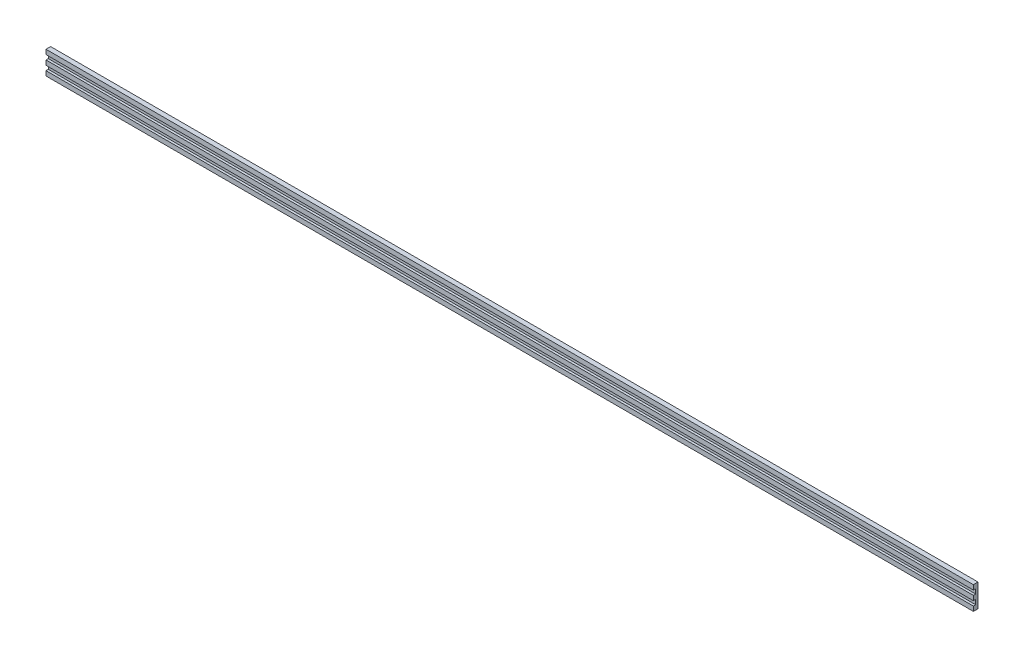
ISO-10303-21;
HEADER;
FILE_DESCRIPTION(('STEP AP214'),'2;1');
FILE_NAME('part.step','',(''),(''),'','','');
FILE_SCHEMA(('AUTOMOTIVE_DESIGN { 1 0 10303 214 1 1 1 1 }'));
ENDSEC;
DATA;
#1=APPLICATION_CONTEXT('core data for automotive mechanical design processes');
#2=APPLICATION_PROTOCOL_DEFINITION('international standard','automotive_design',2000,#1);
#3=PRODUCT_CONTEXT('',#1,'mechanical');
#4=PRODUCT('Part','Part','',(#3));
#5=PRODUCT_RELATED_PRODUCT_CATEGORY('part','',(#4));
#6=PRODUCT_DEFINITION_FORMATION('','',#4);
#7=PRODUCT_DEFINITION_CONTEXT('part definition',#1,'design');
#8=PRODUCT_DEFINITION('design','',#6,#7);
#9=PRODUCT_DEFINITION_SHAPE('','',#8);
#10=(LENGTH_UNIT() NAMED_UNIT(*) SI_UNIT(.MILLI.,.METRE.));
#11=(NAMED_UNIT(*) PLANE_ANGLE_UNIT() SI_UNIT($,.RADIAN.));
#12=(NAMED_UNIT(*) SI_UNIT($,.STERADIAN.) SOLID_ANGLE_UNIT());
#13=UNCERTAINTY_MEASURE_WITH_UNIT(LENGTH_MEASURE(1.E-05),#10,'distance_accuracy_value','');
#14=(GEOMETRIC_REPRESENTATION_CONTEXT(3) GLOBAL_UNCERTAINTY_ASSIGNED_CONTEXT((#13)) GLOBAL_UNIT_ASSIGNED_CONTEXT((#10,
#11,#12)) REPRESENTATION_CONTEXT('',''));
#15=CARTESIAN_POINT('',(0.,0.,0.));
#16=DIRECTION('',(0.,0.,1.));
#17=DIRECTION('',(1.,0.,0.));
#18=AXIS2_PLACEMENT_3D('',#15,#16,#17);
#19=CARTESIAN_POINT('',(0.,0.,0.5));
#20=DIRECTION('',(0.,0.,1.));
#21=DIRECTION('',(1.,0.,0.));
#22=AXIS2_PLACEMENT_3D('',#19,#20,#21);
#23=PLANE('',#22);
#24=DIRECTION('',(0.,-1.,0.));
#25=VECTOR('',#24,1.);
#26=CARTESIAN_POINT('',(-100.,2.5,0.5));
#27=LINE('',#26,#25);
#28=CARTESIAN_POINT('',(-100.,-0.5,0.5));
#29=VERTEX_POINT('',#28);
#30=CARTESIAN_POINT('',(-100.,-1.5,0.5));
#31=VERTEX_POINT('',#30);
#32=EDGE_CURVE('E60',#29,#31,#27,.T.);
#33=ORIENTED_EDGE('',*,*,#32,.T.);
#34=DIRECTION('',(-1.,0.,0.));
#35=VECTOR('',#34,1.);
#36=CARTESIAN_POINT('',(-100.,-1.5,0.5));
#37=LINE('',#36,#35);
#38=CARTESIAN_POINT('',(99.9999999999998,-1.5,0.5));
#39=VERTEX_POINT('',#38);
#40=EDGE_CURVE('E55',#39,#31,#37,.T.);
#41=ORIENTED_EDGE('',*,*,#40,.F.);
#42=DIRECTION('',(0.,1.,0.));
#43=VECTOR('',#42,1.);
#44=CARTESIAN_POINT('',(99.9999999999998,2.5,0.5));
#45=LINE('',#44,#43);
#46=CARTESIAN_POINT('',(99.9999999999998,-0.5,0.5));
#47=VERTEX_POINT('',#46);
#48=EDGE_CURVE('E233',#39,#47,#45,.T.);
#49=ORIENTED_EDGE('',*,*,#48,.T.);
#50=DIRECTION('',(1.,0.,0.));
#51=VECTOR('',#50,1.);
#52=CARTESIAN_POINT('',(-100.,-0.5,0.5));
#53=LINE('',#52,#51);
#54=EDGE_CURVE('E171',#29,#47,#53,.T.);
#55=ORIENTED_EDGE('',*,*,#54,.F.);
#56=EDGE_LOOP('',(#33,#41,#49,#55));
#57=FACE_BOUND('',#56,.T.);
#58=ADVANCED_FACE('F39',(#57),#23,.T.);
#59=CARTESIAN_POINT('',(-100.,1.5,0.5));
#60=VERTEX_POINT('',#59);
#61=CARTESIAN_POINT('',(-100.,0.5,0.5));
#62=VERTEX_POINT('',#61);
#63=EDGE_CURVE('E237',#60,#62,#27,.T.);
#64=ORIENTED_EDGE('',*,*,#63,.T.);
#65=DIRECTION('',(-1.,0.,0.));
#66=VECTOR('',#65,1.);
#67=CARTESIAN_POINT('',(-100.,0.5,0.5));
#68=LINE('',#67,#66);
#69=CARTESIAN_POINT('',(99.9999999999998,0.5,0.5));
#70=VERTEX_POINT('',#69);
#71=EDGE_CURVE('E177',#70,#62,#68,.T.);
#72=ORIENTED_EDGE('',*,*,#71,.F.);
#73=CARTESIAN_POINT('',(99.9999999999998,1.5,0.5));
#74=VERTEX_POINT('',#73);
#75=EDGE_CURVE('E236',#70,#74,#45,.T.);
#76=ORIENTED_EDGE('',*,*,#75,.T.);
#77=DIRECTION('',(1.,0.,0.));
#78=VECTOR('',#77,1.);
#79=CARTESIAN_POINT('',(-100.,1.5,0.5));
#80=LINE('',#79,#78);
#81=EDGE_CURVE('E205',#60,#74,#80,.T.);
#82=ORIENTED_EDGE('',*,*,#81,.F.);
#83=EDGE_LOOP('',(#64,#72,#76,#82));
#84=FACE_BOUND('',#83,.T.);
#85=ADVANCED_FACE('F272',(#84),#23,.T.);
#86=CARTESIAN_POINT('',(99.9999999999998,2.5,0.5));
#87=DIRECTION('',(-1.,0.,0.));
#88=DIRECTION('',(0.,0.,1.));
#89=AXIS2_PLACEMENT_3D('',#86,#87,#88);
#90=PLANE('',#89);
#91=DIRECTION('',(0.,1.,0.));
#92=VECTOR('',#91,1.);
#93=CARTESIAN_POINT('',(99.9999999999998,2.5,0.));
#94=LINE('',#93,#92);
#95=CARTESIAN_POINT('',(99.9999999999998,-2.5,0.));
#96=VERTEX_POINT('',#95);
#97=CARTESIAN_POINT('',(99.9999999999998,2.5,0.));
#98=VERTEX_POINT('',#97);
#99=EDGE_CURVE('E232',#96,#98,#94,.T.);
#100=ORIENTED_EDGE('',*,*,#99,.T.);
#101=DIRECTION('',(0.,0.,-1.));
#102=VECTOR('',#101,1.);
#103=CARTESIAN_POINT('',(99.9999999999998,2.5,0.5));
#104=LINE('',#103,#102);
#105=CARTESIAN_POINT('',(99.9999999999998,2.5,1.));
#106=VERTEX_POINT('',#105);
#107=EDGE_CURVE('E11',#106,#98,#104,.T.);
#108=ORIENTED_EDGE('',*,*,#107,.F.);
#109=DIRECTION('',(0.,1.,0.));
#110=VECTOR('',#109,1.);
#111=CARTESIAN_POINT('',(99.9999999999998,2.5,1.));
#112=LINE('',#111,#110);
#113=CARTESIAN_POINT('',(99.9999999999998,1.5,1.));
#114=VERTEX_POINT('',#113);
#115=EDGE_CURVE('E213',#114,#106,#112,.T.);
#116=ORIENTED_EDGE('',*,*,#115,.F.);
#117=DIRECTION('',(0.,0.,-1.));
#118=VECTOR('',#117,1.);
#119=CARTESIAN_POINT('',(99.9999999999998,1.5,1.));
#120=LINE('',#119,#118);
#121=EDGE_CURVE('E221',#114,#74,#120,.T.);
#122=ORIENTED_EDGE('',*,*,#121,.T.);
#123=ORIENTED_EDGE('',*,*,#75,.F.);
#124=DIRECTION('',(0.,0.,-1.));
#125=VECTOR('',#124,1.);
#126=CARTESIAN_POINT('',(99.9999999999998,0.5,1.));
#127=LINE('',#126,#125);
#128=CARTESIAN_POINT('',(99.9999999999998,0.5,1.));
#129=VERTEX_POINT('',#128);
#130=EDGE_CURVE('E195',#129,#70,#127,.T.);
#131=ORIENTED_EDGE('',*,*,#130,.F.);
#132=DIRECTION('',(0.,1.,0.));
#133=VECTOR('',#132,1.);
#134=CARTESIAN_POINT('',(99.9999999999998,0.5,1.));
#135=LINE('',#134,#133);
#136=CARTESIAN_POINT('',(99.9999999999998,-0.5,1.));
#137=VERTEX_POINT('',#136);
#138=EDGE_CURVE('E180',#137,#129,#135,.T.);
#139=ORIENTED_EDGE('',*,*,#138,.F.);
#140=DIRECTION('',(0.,0.,-1.));
#141=VECTOR('',#140,1.);
#142=CARTESIAN_POINT('',(99.9999999999998,-0.5,1.));
#143=LINE('',#142,#141);
#144=EDGE_CURVE('E198',#137,#47,#143,.T.);
#145=ORIENTED_EDGE('',*,*,#144,.T.);
#146=ORIENTED_EDGE('',*,*,#48,.F.);
#147=DIRECTION('',(0.,0.,-1.));
#148=VECTOR('',#147,1.);
#149=CARTESIAN_POINT('',(99.9999999999998,-1.5,1.));
#150=LINE('',#149,#148);
#151=CARTESIAN_POINT('',(99.9999999999998,-1.5,1.));
#152=VERTEX_POINT('',#151);
#153=EDGE_CURVE('E167',#152,#39,#150,.T.);
#154=ORIENTED_EDGE('',*,*,#153,.F.);
#155=DIRECTION('',(0.,1.,0.));
#156=VECTOR('',#155,1.);
#157=CARTESIAN_POINT('',(99.9999999999998,-2.5,1.));
#158=LINE('',#157,#156);
#159=CARTESIAN_POINT('',(99.9999999999998,-2.5,1.));
#160=VERTEX_POINT('',#159);
#161=EDGE_CURVE('E149',#160,#152,#158,.T.);
#162=ORIENTED_EDGE('',*,*,#161,.F.);
#163=DIRECTION('',(0.,0.,-1.));
#164=VECTOR('',#163,1.);
#165=CARTESIAN_POINT('',(99.9999999999998,-2.5,0.5));
#166=LINE('',#165,#164);
#167=EDGE_CURVE('E140',#160,#96,#166,.T.);
#168=ORIENTED_EDGE('',*,*,#167,.T.);
#169=EDGE_LOOP('',(#100,#108,#116,#122,#123,#131,#139,#145,#146,#154,#162,#168));
#170=FACE_BOUND('',#169,.T.);
#171=ADVANCED_FACE('F41',(#170),#90,.F.);
#172=CARTESIAN_POINT('',(-100.,2.5,0.5));
#173=DIRECTION('',(0.,-1.,0.));
#174=DIRECTION('',(0.,0.,-1.));
#175=AXIS2_PLACEMENT_3D('',#172,#173,#174);
#176=PLANE('',#175);
#177=DIRECTION('',(-1.,0.,0.));
#178=VECTOR('',#177,1.);
#179=CARTESIAN_POINT('',(-100.,2.5,0.));
#180=LINE('',#179,#178);
#181=CARTESIAN_POINT('',(-100.,2.5,0.));
#182=VERTEX_POINT('',#181);
#183=EDGE_CURVE('E244',#98,#182,#180,.T.);
#184=ORIENTED_EDGE('',*,*,#183,.T.);
#185=DIRECTION('',(0.,0.,-1.));
#186=VECTOR('',#185,1.);
#187=CARTESIAN_POINT('',(-100.,2.5,0.5));
#188=LINE('',#187,#186);
#189=CARTESIAN_POINT('',(-100.,2.5,1.));
#190=VERTEX_POINT('',#189);
#191=EDGE_CURVE('E48',#190,#182,#188,.T.);
#192=ORIENTED_EDGE('',*,*,#191,.F.);
#193=DIRECTION('',(-1.,0.,0.));
#194=VECTOR('',#193,1.);
#195=CARTESIAN_POINT('',(-100.,2.5,1.));
#196=LINE('',#195,#194);
#197=EDGE_CURVE('E217',#106,#190,#196,.T.);
#198=ORIENTED_EDGE('',*,*,#197,.F.);
#199=ORIENTED_EDGE('',*,*,#107,.T.);
#200=EDGE_LOOP('',(#184,#192,#198,#199));
#201=FACE_BOUND('',#200,.T.);
#202=ADVANCED_FACE('F281',(#201),#176,.F.);
#203=CARTESIAN_POINT('',(-100.,2.5,0.5));
#204=DIRECTION('',(1.,0.,0.));
#205=DIRECTION('',(0.,0.,-1.));
#206=AXIS2_PLACEMENT_3D('',#203,#204,#205);
#207=PLANE('',#206);
#208=DIRECTION('',(0.,-1.,0.));
#209=VECTOR('',#208,1.);
#210=CARTESIAN_POINT('',(-100.,2.5,0.));
#211=LINE('',#210,#209);
#212=CARTESIAN_POINT('',(-100.,-2.5,0.));
#213=VERTEX_POINT('',#212);
#214=EDGE_CURVE('E136',#182,#213,#211,.T.);
#215=ORIENTED_EDGE('',*,*,#214,.T.);
#216=DIRECTION('',(0.,0.,-1.));
#217=VECTOR('',#216,1.);
#218=CARTESIAN_POINT('',(-100.,-2.5,0.5));
#219=LINE('',#218,#217);
#220=CARTESIAN_POINT('',(-100.,-2.5,1.));
#221=VERTEX_POINT('',#220);
#222=EDGE_CURVE('E128',#221,#213,#219,.T.);
#223=ORIENTED_EDGE('',*,*,#222,.F.);
#224=DIRECTION('',(0.,-1.,0.));
#225=VECTOR('',#224,1.);
#226=CARTESIAN_POINT('',(-100.,-2.5,1.));
#227=LINE('',#226,#225);
#228=CARTESIAN_POINT('',(-100.,-1.5,1.));
#229=VERTEX_POINT('',#228);
#230=EDGE_CURVE('E133',#229,#221,#227,.T.);
#231=ORIENTED_EDGE('',*,*,#230,.F.);
#232=DIRECTION('',(0.,0.,-1.));
#233=VECTOR('',#232,1.);
#234=CARTESIAN_POINT('',(-100.,-1.5,1.));
#235=LINE('',#234,#233);
#236=EDGE_CURVE('E163',#229,#31,#235,.T.);
#237=ORIENTED_EDGE('',*,*,#236,.T.);
#238=ORIENTED_EDGE('',*,*,#32,.F.);
#239=DIRECTION('',(0.,0.,-1.));
#240=VECTOR('',#239,1.);
#241=CARTESIAN_POINT('',(-100.,-0.5,1.));
#242=LINE('',#241,#240);
#243=CARTESIAN_POINT('',(-100.,-0.5,1.));
#244=VERTEX_POINT('',#243);
#245=EDGE_CURVE('E202',#244,#29,#242,.T.);
#246=ORIENTED_EDGE('',*,*,#245,.F.);
#247=DIRECTION('',(0.,-1.,0.));
#248=VECTOR('',#247,1.);
#249=CARTESIAN_POINT('',(-100.,0.5,1.));
#250=LINE('',#249,#248);
#251=CARTESIAN_POINT('',(-100.,0.5,1.));
#252=VERTEX_POINT('',#251);
#253=EDGE_CURVE('E172',#252,#244,#250,.T.);
#254=ORIENTED_EDGE('',*,*,#253,.F.);
#255=DIRECTION('',(0.,0.,-1.));
#256=VECTOR('',#255,1.);
#257=CARTESIAN_POINT('',(-100.,0.5,1.));
#258=LINE('',#257,#256);
#259=EDGE_CURVE('E186',#252,#62,#258,.T.);
#260=ORIENTED_EDGE('',*,*,#259,.T.);
#261=ORIENTED_EDGE('',*,*,#63,.F.);
#262=DIRECTION('',(0.,0.,-1.));
#263=VECTOR('',#262,1.);
#264=CARTESIAN_POINT('',(-100.,1.5,1.));
#265=LINE('',#264,#263);
#266=CARTESIAN_POINT('',(-100.,1.5,1.));
#267=VERTEX_POINT('',#266);
#268=EDGE_CURVE('E228',#267,#60,#265,.T.);
#269=ORIENTED_EDGE('',*,*,#268,.F.);
#270=DIRECTION('',(0.,-1.,0.));
#271=VECTOR('',#270,1.);
#272=CARTESIAN_POINT('',(-100.,2.5,1.));
#273=LINE('',#272,#271);
#274=EDGE_CURVE('E206',#190,#267,#273,.T.);
#275=ORIENTED_EDGE('',*,*,#274,.F.);
#276=ORIENTED_EDGE('',*,*,#191,.T.);
#277=EDGE_LOOP('',(#215,#223,#231,#237,#238,#246,#254,#260,#261,#269,#275,#276));
#278=FACE_BOUND('',#277,.T.);
#279=ADVANCED_FACE('F130',(#278),#207,.F.);
#280=CARTESIAN_POINT('',(-100.,-2.5,0.5));
#281=DIRECTION('',(0.,1.,0.));
#282=DIRECTION('',(0.,0.,1.));
#283=AXIS2_PLACEMENT_3D('',#280,#281,#282);
#284=PLANE('',#283);
#285=DIRECTION('',(1.,0.,0.));
#286=VECTOR('',#285,1.);
#287=CARTESIAN_POINT('',(-100.,-2.5,0.));
#288=LINE('',#287,#286);
#289=EDGE_CURVE('E249',#213,#96,#288,.T.);
#290=ORIENTED_EDGE('',*,*,#289,.T.);
#291=ORIENTED_EDGE('',*,*,#167,.F.);
#292=DIRECTION('',(1.,0.,0.));
#293=VECTOR('',#292,1.);
#294=CARTESIAN_POINT('',(-100.,-2.5,1.));
#295=LINE('',#294,#293);
#296=EDGE_CURVE('E143',#221,#160,#295,.T.);
#297=ORIENTED_EDGE('',*,*,#296,.F.);
#298=ORIENTED_EDGE('',*,*,#222,.T.);
#299=EDGE_LOOP('',(#290,#291,#297,#298));
#300=FACE_BOUND('',#299,.T.);
#301=ADVANCED_FACE('F144',(#300),#284,.F.);
#302=CARTESIAN_POINT('',(0.,0.,0.));
#303=DIRECTION('',(0.,0.,1.));
#304=DIRECTION('',(1.,0.,0.));
#305=AXIS2_PLACEMENT_3D('',#302,#303,#304);
#306=PLANE('',#305);
#307=ORIENTED_EDGE('',*,*,#99,.F.);
#308=ORIENTED_EDGE('',*,*,#289,.F.);
#309=ORIENTED_EDGE('',*,*,#214,.F.);
#310=ORIENTED_EDGE('',*,*,#183,.F.);
#311=EDGE_LOOP('',(#307,#308,#309,#310));
#312=FACE_BOUND('',#311,.T.);
#313=ADVANCED_FACE('F260',(#312),#306,.F.);
#314=CARTESIAN_POINT('',(-100.,1.5,1.));
#315=DIRECTION('',(0.,1.,0.));
#316=DIRECTION('',(0.,0.,1.));
#317=AXIS2_PLACEMENT_3D('',#314,#315,#316);
#318=PLANE('',#317);
#319=ORIENTED_EDGE('',*,*,#81,.T.);
#320=ORIENTED_EDGE('',*,*,#121,.F.);
#321=DIRECTION('',(1.,0.,0.));
#322=VECTOR('',#321,1.);
#323=CARTESIAN_POINT('',(-100.,1.5,1.));
#324=LINE('',#323,#322);
#325=EDGE_CURVE('E210',#267,#114,#324,.T.);
#326=ORIENTED_EDGE('',*,*,#325,.F.);
#327=ORIENTED_EDGE('',*,*,#268,.T.);
#328=EDGE_LOOP('',(#319,#320,#326,#327));
#329=FACE_BOUND('',#328,.T.);
#330=ADVANCED_FACE('F277',(#329),#318,.F.);
#331=CARTESIAN_POINT('',(0.,0.,1.));
#332=DIRECTION('',(0.,0.,1.));
#333=DIRECTION('',(1.,0.,0.));
#334=AXIS2_PLACEMENT_3D('',#331,#332,#333);
#335=PLANE('',#334);
#336=ORIENTED_EDGE('',*,*,#274,.T.);
#337=ORIENTED_EDGE('',*,*,#325,.T.);
#338=ORIENTED_EDGE('',*,*,#115,.T.);
#339=ORIENTED_EDGE('',*,*,#197,.T.);
#340=EDGE_LOOP('',(#336,#337,#338,#339));
#341=FACE_BOUND('',#340,.T.);
#342=ADVANCED_FACE('F280',(#341),#335,.T.);
#343=CARTESIAN_POINT('',(-100.,-0.5,1.));
#344=DIRECTION('',(0.,1.,0.));
#345=DIRECTION('',(0.,0.,1.));
#346=AXIS2_PLACEMENT_3D('',#343,#344,#345);
#347=PLANE('',#346);
#348=ORIENTED_EDGE('',*,*,#54,.T.);
#349=ORIENTED_EDGE('',*,*,#144,.F.);
#350=DIRECTION('',(1.,0.,0.));
#351=VECTOR('',#350,1.);
#352=CARTESIAN_POINT('',(-100.,-0.5,1.));
#353=LINE('',#352,#351);
#354=EDGE_CURVE('E176',#244,#137,#353,.T.);
#355=ORIENTED_EDGE('',*,*,#354,.F.);
#356=ORIENTED_EDGE('',*,*,#245,.T.);
#357=EDGE_LOOP('',(#348,#349,#355,#356));
#358=FACE_BOUND('',#357,.T.);
#359=ADVANCED_FACE('F318',(#358),#347,.F.);
#360=CARTESIAN_POINT('',(-100.,0.5,1.));
#361=DIRECTION('',(0.,-1.,0.));
#362=DIRECTION('',(1.,0.,0.));
#363=AXIS2_PLACEMENT_3D('',#360,#361,#362);
#364=PLANE('',#363);
#365=ORIENTED_EDGE('',*,*,#71,.T.);
#366=ORIENTED_EDGE('',*,*,#259,.F.);
#367=DIRECTION('',(-1.,0.,0.));
#368=VECTOR('',#367,1.);
#369=CARTESIAN_POINT('',(-100.,0.5,1.));
#370=LINE('',#369,#368);
#371=EDGE_CURVE('E183',#129,#252,#370,.T.);
#372=ORIENTED_EDGE('',*,*,#371,.F.);
#373=ORIENTED_EDGE('',*,*,#130,.T.);
#374=EDGE_LOOP('',(#365,#366,#372,#373));
#375=FACE_BOUND('',#374,.T.);
#376=ADVANCED_FACE('F324',(#375),#364,.F.);
#377=CARTESIAN_POINT('',(0.,0.,1.));
#378=DIRECTION('',(0.,0.,1.));
#379=DIRECTION('',(1.,0.,0.));
#380=AXIS2_PLACEMENT_3D('',#377,#378,#379);
#381=PLANE('',#380);
#382=ORIENTED_EDGE('',*,*,#253,.T.);
#383=ORIENTED_EDGE('',*,*,#354,.T.);
#384=ORIENTED_EDGE('',*,*,#138,.T.);
#385=ORIENTED_EDGE('',*,*,#371,.T.);
#386=EDGE_LOOP('',(#382,#383,#384,#385));
#387=FACE_BOUND('',#386,.T.);
#388=ADVANCED_FACE('F332',(#387),#381,.T.);
#389=CARTESIAN_POINT('',(-100.,-1.5,1.));
#390=DIRECTION('',(0.,-1.,0.));
#391=DIRECTION('',(0.,0.,-1.));
#392=AXIS2_PLACEMENT_3D('',#389,#390,#391);
#393=PLANE('',#392);
#394=ORIENTED_EDGE('',*,*,#40,.T.);
#395=ORIENTED_EDGE('',*,*,#236,.F.);
#396=DIRECTION('',(-1.,0.,0.));
#397=VECTOR('',#396,1.);
#398=CARTESIAN_POINT('',(-100.,-1.5,1.));
#399=LINE('',#398,#397);
#400=EDGE_CURVE('E153',#152,#229,#399,.T.);
#401=ORIENTED_EDGE('',*,*,#400,.F.);
#402=ORIENTED_EDGE('',*,*,#153,.T.);
#403=EDGE_LOOP('',(#394,#395,#401,#402));
#404=FACE_BOUND('',#403,.T.);
#405=ADVANCED_FACE('F264',(#404),#393,.F.);
#406=CARTESIAN_POINT('',(0.,0.,1.));
#407=DIRECTION('',(0.,0.,-1.));
#408=DIRECTION('',(-1.,0.,0.));
#409=AXIS2_PLACEMENT_3D('',#406,#407,#408);
#410=PLANE('',#409);
#411=ORIENTED_EDGE('',*,*,#230,.T.);
#412=ORIENTED_EDGE('',*,*,#296,.T.);
#413=ORIENTED_EDGE('',*,*,#161,.T.);
#414=ORIENTED_EDGE('',*,*,#400,.T.);
#415=EDGE_LOOP('',(#411,#412,#413,#414));
#416=FACE_BOUND('',#415,.T.);
#417=ADVANCED_FACE('F151',(#416),#410,.F.);
#418=CLOSED_SHELL('',(#58,#85,#171,#202,#279,#301,#313,#330,#342,#359,#376,#388,#405,#417));
#419=MANIFOLD_SOLID_BREP('B2',#418);
#420=ADVANCED_BREP_SHAPE_REPRESENTATION('',(#18,#419),#14);
#421=SHAPE_DEFINITION_REPRESENTATION(#9,#420);
ENDSEC;
END-ISO-10303-21;
